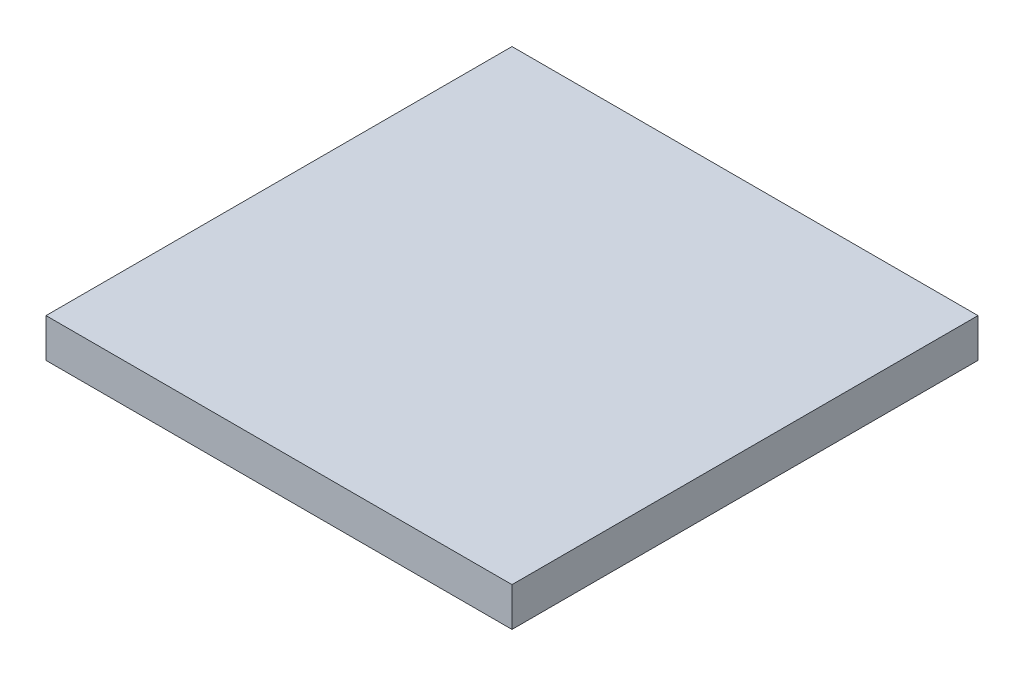
ISO-10303-21;
HEADER;
FILE_DESCRIPTION(('STEP AP214'),'2;1');
FILE_NAME('part.step','',(''),(''),'','','');
FILE_SCHEMA(('AUTOMOTIVE_DESIGN { 1 0 10303 214 1 1 1 1 }'));
ENDSEC;
DATA;
#1=APPLICATION_CONTEXT('core data for automotive mechanical design processes');
#2=APPLICATION_PROTOCOL_DEFINITION('international standard','automotive_design',2000,#1);
#3=PRODUCT_CONTEXT('',#1,'mechanical');
#4=PRODUCT('Part','Part','',(#3));
#5=PRODUCT_RELATED_PRODUCT_CATEGORY('part','',(#4));
#6=PRODUCT_DEFINITION_FORMATION('','',#4);
#7=PRODUCT_DEFINITION_CONTEXT('part definition',#1,'design');
#8=PRODUCT_DEFINITION('design','',#6,#7);
#9=PRODUCT_DEFINITION_SHAPE('','',#8);
#10=(LENGTH_UNIT() NAMED_UNIT(*) SI_UNIT(.MILLI.,.METRE.));
#11=(NAMED_UNIT(*) PLANE_ANGLE_UNIT() SI_UNIT($,.RADIAN.));
#12=(NAMED_UNIT(*) SI_UNIT($,.STERADIAN.) SOLID_ANGLE_UNIT());
#13=UNCERTAINTY_MEASURE_WITH_UNIT(LENGTH_MEASURE(1.E-05),#10,'distance_accuracy_value','');
#14=(GEOMETRIC_REPRESENTATION_CONTEXT(3) GLOBAL_UNCERTAINTY_ASSIGNED_CONTEXT((#13)) GLOBAL_UNIT_ASSIGNED_CONTEXT((#10,
#11,#12)) REPRESENTATION_CONTEXT('',''));
#15=CARTESIAN_POINT('',(0.,0.,0.));
#16=DIRECTION('',(0.,0.,1.));
#17=DIRECTION('',(1.,0.,0.));
#18=AXIS2_PLACEMENT_3D('',#15,#16,#17);
#19=CARTESIAN_POINT('',(0.6,0.1,-0.6));
#20=DIRECTION('',(-1.,0.,0.));
#21=DIRECTION('',(0.,0.,1.));
#22=AXIS2_PLACEMENT_3D('',#19,#20,#21);
#23=PLANE('',#22);
#24=DIRECTION('',(0.,0.,-1.));
#25=VECTOR('',#24,1.);
#26=CARTESIAN_POINT('',(0.6,0.,-0.6));
#27=LINE('',#26,#25);
#28=CARTESIAN_POINT('',(0.6,0.,0.6));
#29=VERTEX_POINT('',#28);
#30=CARTESIAN_POINT('',(0.6,0.,-0.6));
#31=VERTEX_POINT('',#30);
#32=EDGE_CURVE('E98',#29,#31,#27,.T.);
#33=ORIENTED_EDGE('',*,*,#32,.T.);
#34=DIRECTION('',(0.,-1.,0.));
#35=VECTOR('',#34,1.);
#36=CARTESIAN_POINT('',(0.6,0.1,-0.6));
#37=LINE('',#36,#35);
#38=CARTESIAN_POINT('',(0.6,0.1,-0.6));
#39=VERTEX_POINT('',#38);
#40=EDGE_CURVE('E11',#39,#31,#37,.T.);
#41=ORIENTED_EDGE('',*,*,#40,.F.);
#42=DIRECTION('',(0.,0.,-1.));
#43=VECTOR('',#42,1.);
#44=CARTESIAN_POINT('',(0.6,0.1,-0.6));
#45=LINE('',#44,#43);
#46=CARTESIAN_POINT('',(0.6,0.1,0.6));
#47=VERTEX_POINT('',#46);
#48=EDGE_CURVE('E86',#47,#39,#45,.T.);
#49=ORIENTED_EDGE('',*,*,#48,.F.);
#50=DIRECTION('',(0.,-1.,0.));
#51=VECTOR('',#50,1.);
#52=CARTESIAN_POINT('',(0.6,0.1,0.6));
#53=LINE('',#52,#51);
#54=EDGE_CURVE('E94',#47,#29,#53,.T.);
#55=ORIENTED_EDGE('',*,*,#54,.T.);
#56=EDGE_LOOP('',(#33,#41,#49,#55));
#57=FACE_BOUND('',#56,.T.);
#58=ADVANCED_FACE('F35',(#57),#23,.F.);
#59=CARTESIAN_POINT('',(-0.6,0.1,-0.6));
#60=DIRECTION('',(0.,0.,1.));
#61=DIRECTION('',(1.,0.,0.));
#62=AXIS2_PLACEMENT_3D('',#59,#60,#61);
#63=PLANE('',#62);
#64=DIRECTION('',(-1.,0.,0.));
#65=VECTOR('',#64,1.);
#66=CARTESIAN_POINT('',(-0.6,0.,-0.6));
#67=LINE('',#66,#65);
#68=CARTESIAN_POINT('',(-0.6,0.,-0.6));
#69=VERTEX_POINT('',#68);
#70=EDGE_CURVE('E90',#31,#69,#67,.T.);
#71=ORIENTED_EDGE('',*,*,#70,.T.);
#72=DIRECTION('',(0.,-1.,0.));
#73=VECTOR('',#72,1.);
#74=CARTESIAN_POINT('',(-0.6,0.1,-0.6));
#75=LINE('',#74,#73);
#76=CARTESIAN_POINT('',(-0.6,0.1,-0.6));
#77=VERTEX_POINT('',#76);
#78=EDGE_CURVE('E43',#77,#69,#75,.T.);
#79=ORIENTED_EDGE('',*,*,#78,.F.);
#80=DIRECTION('',(-1.,0.,0.));
#81=VECTOR('',#80,1.);
#82=CARTESIAN_POINT('',(-0.6,0.1,-0.6));
#83=LINE('',#82,#81);
#84=EDGE_CURVE('E81',#39,#77,#83,.T.);
#85=ORIENTED_EDGE('',*,*,#84,.F.);
#86=ORIENTED_EDGE('',*,*,#40,.T.);
#87=EDGE_LOOP('',(#71,#79,#85,#86));
#88=FACE_BOUND('',#87,.T.);
#89=ADVANCED_FACE('F89',(#88),#63,.F.);
#90=CARTESIAN_POINT('',(-0.6,0.1,-0.6));
#91=DIRECTION('',(1.,0.,0.));
#92=DIRECTION('',(0.,0.,-1.));
#93=AXIS2_PLACEMENT_3D('',#90,#91,#92);
#94=PLANE('',#93);
#95=DIRECTION('',(0.,0.,1.));
#96=VECTOR('',#95,1.);
#97=CARTESIAN_POINT('',(-0.6,0.,-0.6));
#98=LINE('',#97,#96);
#99=CARTESIAN_POINT('',(-0.6,0.,0.6));
#100=VERTEX_POINT('',#99);
#101=EDGE_CURVE('E68',#69,#100,#98,.T.);
#102=ORIENTED_EDGE('',*,*,#101,.T.);
#103=DIRECTION('',(0.,-1.,0.));
#104=VECTOR('',#103,1.);
#105=CARTESIAN_POINT('',(-0.6,0.1,0.6));
#106=LINE('',#105,#104);
#107=CARTESIAN_POINT('',(-0.6,0.1,0.6));
#108=VERTEX_POINT('',#107);
#109=EDGE_CURVE('E91',#108,#100,#106,.T.);
#110=ORIENTED_EDGE('',*,*,#109,.F.);
#111=DIRECTION('',(0.,0.,1.));
#112=VECTOR('',#111,1.);
#113=CARTESIAN_POINT('',(-0.6,0.1,-0.6));
#114=LINE('',#113,#112);
#115=EDGE_CURVE('E84',#77,#108,#114,.T.);
#116=ORIENTED_EDGE('',*,*,#115,.F.);
#117=ORIENTED_EDGE('',*,*,#78,.T.);
#118=EDGE_LOOP('',(#102,#110,#116,#117));
#119=FACE_BOUND('',#118,.T.);
#120=ADVANCED_FACE('F92',(#119),#94,.F.);
#121=CARTESIAN_POINT('',(-0.6,0.1,0.6));
#122=DIRECTION('',(0.,0.,-1.));
#123=DIRECTION('',(-1.,0.,0.));
#124=AXIS2_PLACEMENT_3D('',#121,#122,#123);
#125=PLANE('',#124);
#126=DIRECTION('',(1.,0.,0.));
#127=VECTOR('',#126,1.);
#128=CARTESIAN_POINT('',(-0.6,0.,0.6));
#129=LINE('',#128,#127);
#130=EDGE_CURVE('E74',#100,#29,#129,.T.);
#131=ORIENTED_EDGE('',*,*,#130,.T.);
#132=ORIENTED_EDGE('',*,*,#54,.F.);
#133=DIRECTION('',(1.,0.,0.));
#134=VECTOR('',#133,1.);
#135=CARTESIAN_POINT('',(-0.6,0.1,0.6));
#136=LINE('',#135,#134);
#137=EDGE_CURVE('E51',#108,#47,#136,.T.);
#138=ORIENTED_EDGE('',*,*,#137,.F.);
#139=ORIENTED_EDGE('',*,*,#109,.T.);
#140=EDGE_LOOP('',(#131,#132,#138,#139));
#141=FACE_BOUND('',#140,.T.);
#142=ADVANCED_FACE('F105',(#141),#125,.F.);
#143=CARTESIAN_POINT('',(0.,0.1,0.));
#144=DIRECTION('',(0.,1.,0.));
#145=DIRECTION('',(0.,0.,1.));
#146=AXIS2_PLACEMENT_3D('',#143,#144,#145);
#147=PLANE('',#146);
#148=ORIENTED_EDGE('',*,*,#48,.T.);
#149=ORIENTED_EDGE('',*,*,#84,.T.);
#150=ORIENTED_EDGE('',*,*,#115,.T.);
#151=ORIENTED_EDGE('',*,*,#137,.T.);
#152=EDGE_LOOP('',(#148,#149,#150,#151));
#153=FACE_BOUND('',#152,.T.);
#154=ADVANCED_FACE('F82',(#153),#147,.T.);
#155=CARTESIAN_POINT('',(0.,0.,0.));
#156=DIRECTION('',(0.,1.,0.));
#157=DIRECTION('',(0.,0.,1.));
#158=AXIS2_PLACEMENT_3D('',#155,#156,#157);
#159=PLANE('',#158);
#160=ORIENTED_EDGE('',*,*,#32,.F.);
#161=ORIENTED_EDGE('',*,*,#130,.F.);
#162=ORIENTED_EDGE('',*,*,#101,.F.);
#163=ORIENTED_EDGE('',*,*,#70,.F.);
#164=EDGE_LOOP('',(#160,#161,#162,#163));
#165=FACE_BOUND('',#164,.T.);
#166=ADVANCED_FACE('F108',(#165),#159,.F.);
#167=CLOSED_SHELL('',(#58,#89,#120,#142,#154,#166));
#168=MANIFOLD_SOLID_BREP('B2',#167);
#169=ADVANCED_BREP_SHAPE_REPRESENTATION('',(#18,#168),#14);
#170=SHAPE_DEFINITION_REPRESENTATION(#9,#169);
ENDSEC;
END-ISO-10303-21;
